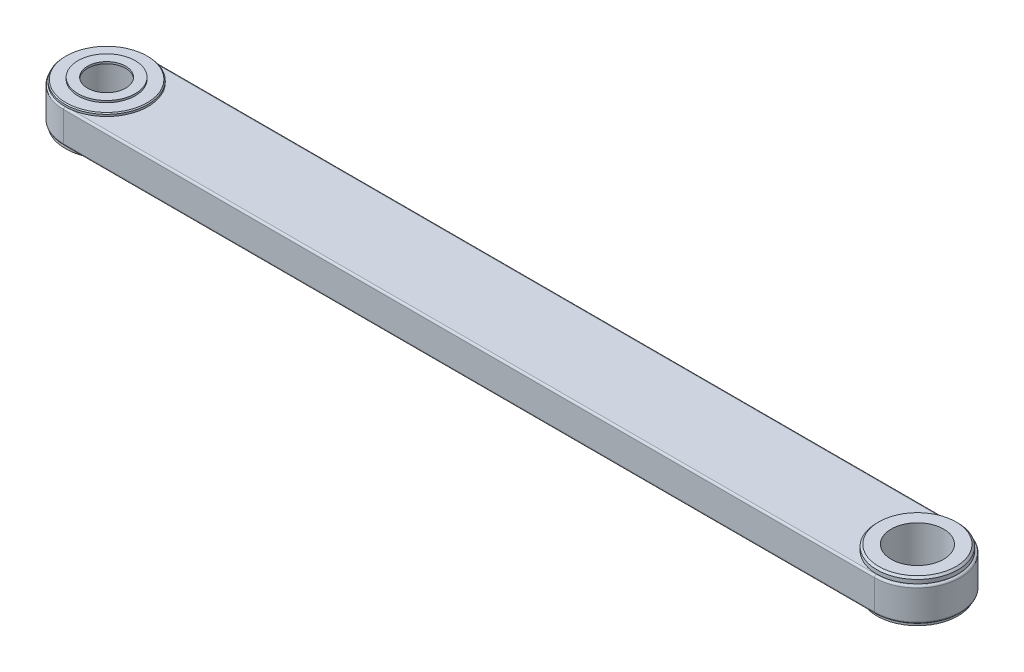
ISO-10303-21;
HEADER;
FILE_DESCRIPTION(('STEP AP214'),'2;1');
FILE_NAME('part.step','',(''),(''),'','','');
FILE_SCHEMA(('AUTOMOTIVE_DESIGN { 1 0 10303 214 1 1 1 1 }'));
ENDSEC;
DATA;
#1=APPLICATION_CONTEXT('core data for automotive mechanical design processes');
#2=APPLICATION_PROTOCOL_DEFINITION('international standard','automotive_design',2000,#1);
#3=PRODUCT_CONTEXT('',#1,'mechanical');
#4=PRODUCT('Part','Part','',(#3));
#5=PRODUCT_RELATED_PRODUCT_CATEGORY('part','',(#4));
#6=PRODUCT_DEFINITION_FORMATION('','',#4);
#7=PRODUCT_DEFINITION_CONTEXT('part definition',#1,'design');
#8=PRODUCT_DEFINITION('design','',#6,#7);
#9=PRODUCT_DEFINITION_SHAPE('','',#8);
#10=(LENGTH_UNIT() NAMED_UNIT(*) SI_UNIT(.MILLI.,.METRE.));
#11=(NAMED_UNIT(*) PLANE_ANGLE_UNIT() SI_UNIT($,.RADIAN.));
#12=(NAMED_UNIT(*) SI_UNIT($,.STERADIAN.) SOLID_ANGLE_UNIT());
#13=UNCERTAINTY_MEASURE_WITH_UNIT(LENGTH_MEASURE(1.E-05),#10,'distance_accuracy_value','');
#14=(GEOMETRIC_REPRESENTATION_CONTEXT(3) GLOBAL_UNCERTAINTY_ASSIGNED_CONTEXT((#13)) GLOBAL_UNIT_ASSIGNED_CONTEXT((#10,
#11,#12)) REPRESENTATION_CONTEXT('',''));
#15=CARTESIAN_POINT('',(0.,0.,0.));
#16=DIRECTION('',(0.,0.,1.));
#17=DIRECTION('',(1.,0.,0.));
#18=AXIS2_PLACEMENT_3D('',#15,#16,#17);
#19=CARTESIAN_POINT('',(1237.10701703495,162.,1587.00959301561));
#20=DIRECTION('',(0.,-1.,0.));
#21=DIRECTION('',(1.,0.,0.));
#22=AXIS2_PLACEMENT_3D('',#19,#20,#21);
#23=CYLINDRICAL_SURFACE('',#22,42.5);
#24=CARTESIAN_POINT('',(1237.10701703495,160.,1587.00959301561));
#25=DIRECTION('',(0.,-1.,0.));
#26=DIRECTION('',(0.,0.,1.));
#27=AXIS2_PLACEMENT_3D('',#24,#25,#26);
#28=CIRCLE('',#27,42.5);
#29=CARTESIAN_POINT('',(1237.10701703495,160.,1629.50959301561));
#30=VERTEX_POINT('',#29);
#31=EDGE_CURVE('E11',#30,#30,#28,.T.);
#32=ORIENTED_EDGE('',*,*,#31,.T.);
#33=EDGE_LOOP('',(#32));
#34=FACE_BOUND('',#33,.T.);
#35=CARTESIAN_POINT('',(1237.10701703495,156.,1587.00959301561));
#36=DIRECTION('',(0.,1.,0.));
#37=DIRECTION('',(0.,0.,1.));
#38=AXIS2_PLACEMENT_3D('',#35,#36,#37);
#39=CIRCLE('',#38,42.5);
#40=CARTESIAN_POINT('',(1237.10701703495,156.,1629.50959301561));
#41=VERTEX_POINT('',#40);
#42=EDGE_CURVE('E52',#41,#41,#39,.T.);
#43=ORIENTED_EDGE('',*,*,#42,.T.);
#44=EDGE_LOOP('',(#43));
#45=FACE_BOUND('',#44,.T.);
#46=ADVANCED_FACE('F42',(#34,#45),#23,.T.);
#47=CARTESIAN_POINT('',(1237.10701703495,162.,1587.00959301561));
#48=DIRECTION('',(0.,1.,0.));
#49=DIRECTION('',(1.,0.,0.));
#50=AXIS2_PLACEMENT_3D('',#47,#48,#49);
#51=PLANE('',#50);
#52=CARTESIAN_POINT('',(1237.10701703495,162.,1587.00959301561));
#53=DIRECTION('',(0.,-1.,0.));
#54=DIRECTION('',(0.,0.,-1.));
#55=AXIS2_PLACEMENT_3D('',#52,#53,#54);
#56=CIRCLE('',#55,27.5);
#57=CARTESIAN_POINT('',(1237.10701703495,162.,1559.50959301561));
#58=VERTEX_POINT('',#57);
#59=EDGE_CURVE('E195',#58,#58,#56,.T.);
#60=ORIENTED_EDGE('',*,*,#59,.T.);
#61=EDGE_LOOP('',(#60));
#62=FACE_BOUND('',#61,.T.);
#63=CARTESIAN_POINT('',(1237.10701703495,162.,1587.00959301561));
#64=DIRECTION('',(0.,1.,0.));
#65=DIRECTION('',(0.,0.,1.));
#66=AXIS2_PLACEMENT_3D('',#63,#64,#65);
#67=CIRCLE('',#66,40.5);
#68=CARTESIAN_POINT('',(1237.10701703495,162.,1627.50959301561));
#69=VERTEX_POINT('',#68);
#70=EDGE_CURVE('E192',#69,#69,#67,.T.);
#71=ORIENTED_EDGE('',*,*,#70,.T.);
#72=EDGE_LOOP('',(#71));
#73=FACE_BOUND('',#72,.T.);
#74=ADVANCED_FACE('F323',(#62,#73),#51,.T.);
#75=CARTESIAN_POINT('',(1237.10701703495,160.,1587.00959301561));
#76=DIRECTION('',(0.,-1.,0.));
#77=DIRECTION('',(0.,0.,-1.));
#78=AXIS2_PLACEMENT_3D('',#75,#76,#77);
#79=CONICAL_SURFACE('',#78,42.5,0.785398162499998);
#80=ORIENTED_EDGE('',*,*,#70,.F.);
#81=EDGE_LOOP('',(#80));
#82=FACE_BOUND('',#81,.T.);
#83=ORIENTED_EDGE('',*,*,#31,.F.);
#84=EDGE_LOOP('',(#83));
#85=FACE_BOUND('',#84,.T.);
#86=ADVANCED_FACE('F329',(#82,#85),#79,.T.);
#87=CARTESIAN_POINT('',(1237.10701703495,156.,1587.00959301562));
#88=DIRECTION('',(0.,-1.,0.));
#89=DIRECTION('',(0.,0.,-1.));
#90=AXIS2_PLACEMENT_3D('',#87,#88,#89);
#91=CYLINDRICAL_SURFACE('',#90,45.);
#92=DIRECTION('',(0.,-1.,0.));
#93=VECTOR('',#92,1.);
#94=CARTESIAN_POINT('',(1237.10701703495,156.,1632.00959301562));
#95=LINE('',#94,#93);
#96=CARTESIAN_POINT('',(1237.10701703495,154.,1632.00959301562));
#97=VERTEX_POINT('',#96);
#98=CARTESIAN_POINT('',(1237.10701703495,123.,1632.00959301562));
#99=VERTEX_POINT('',#98);
#100=EDGE_CURVE('E157',#97,#99,#95,.T.);
#101=ORIENTED_EDGE('',*,*,#100,.T.);
#102=CARTESIAN_POINT('',(1237.10701703495,123.,1587.00959301562));
#103=DIRECTION('',(0.,1.,0.));
#104=DIRECTION('',(0.,0.,1.));
#105=AXIS2_PLACEMENT_3D('',#102,#103,#104);
#106=CIRCLE('',#105,45.);
#107=CARTESIAN_POINT('',(1237.10701703495,123.,1542.00959301562));
#108=VERTEX_POINT('',#107);
#109=EDGE_CURVE('E154',#99,#108,#106,.T.);
#110=ORIENTED_EDGE('',*,*,#109,.T.);
#111=DIRECTION('',(0.,-1.,0.));
#112=VECTOR('',#111,1.);
#113=CARTESIAN_POINT('',(1237.10701703495,156.,1542.00959301562));
#114=LINE('',#113,#112);
#115=CARTESIAN_POINT('',(1237.10701703495,154.,1542.00959301562));
#116=VERTEX_POINT('',#115);
#117=EDGE_CURVE('E179',#116,#108,#114,.T.);
#118=ORIENTED_EDGE('',*,*,#117,.F.);
#119=CARTESIAN_POINT('',(1237.10701703495,154.,1587.00959301562));
#120=DIRECTION('',(0.,-1.,0.));
#121=DIRECTION('',(0.,0.,1.));
#122=AXIS2_PLACEMENT_3D('',#119,#120,#121);
#123=CIRCLE('',#122,45.);
#124=EDGE_CURVE('E158',#116,#97,#123,.T.);
#125=ORIENTED_EDGE('',*,*,#124,.T.);
#126=EDGE_LOOP('',(#101,#110,#118,#125));
#127=FACE_BOUND('',#126,.T.);
#128=ADVANCED_FACE('F418',(#127),#91,.T.);
#129=CARTESIAN_POINT('',(1237.10701703495,156.,1587.00959301562));
#130=DIRECTION('',(0.,1.,0.));
#131=DIRECTION('',(1.,0.,0.));
#132=AXIS2_PLACEMENT_3D('',#129,#130,#131);
#133=PLANE('',#132);
#134=CARTESIAN_POINT('',(387.107017034954,156.,1587.00959301561));
#135=DIRECTION('',(0.,-1.,0.));
#136=DIRECTION('',(0.,0.,1.));
#137=AXIS2_PLACEMENT_3D('',#134,#135,#136);
#138=CIRCLE('',#137,43.5);
#139=CARTESIAN_POINT('',(393.683490253971,156.,1544.00959301562));
#140=VERTEX_POINT('',#139);
#141=CARTESIAN_POINT('',(393.683490253904,156.,1630.00959301562));
#142=VERTEX_POINT('',#141);
#143=EDGE_CURVE('E244',#140,#142,#138,.T.);
#144=ORIENTED_EDGE('',*,*,#143,.T.);
#145=DIRECTION('',(1.,0.,0.));
#146=VECTOR('',#145,1.);
#147=CARTESIAN_POINT('',(1237.10701703495,156.,1630.00959301562));
#148=LINE('',#147,#146);
#149=CARTESIAN_POINT('',(1237.10701703495,156.,1630.00959301562));
#150=VERTEX_POINT('',#149);
#151=EDGE_CURVE('E241',#142,#150,#148,.T.);
#152=ORIENTED_EDGE('',*,*,#151,.T.);
#153=CARTESIAN_POINT('',(1237.10701703495,156.,1587.00959301562));
#154=DIRECTION('',(0.,1.,0.));
#155=DIRECTION('',(0.,0.,1.));
#156=AXIS2_PLACEMENT_3D('',#153,#154,#155);
#157=CIRCLE('',#156,43.);
#158=CARTESIAN_POINT('',(1237.10701703495,156.,1544.00959301562));
#159=VERTEX_POINT('',#158);
#160=EDGE_CURVE('E46',#150,#159,#157,.T.);
#161=ORIENTED_EDGE('',*,*,#160,.T.);
#162=DIRECTION('',(-1.,0.,0.));
#163=VECTOR('',#162,1.);
#164=CARTESIAN_POINT('',(387.107017034954,156.,1544.00959301562));
#165=LINE('',#164,#163);
#166=EDGE_CURVE('E147',#159,#140,#165,.T.);
#167=ORIENTED_EDGE('',*,*,#166,.T.);
#168=EDGE_LOOP('',(#144,#152,#161,#167));
#169=FACE_BOUND('',#168,.T.);
#170=ORIENTED_EDGE('',*,*,#42,.F.);
#171=EDGE_LOOP('',(#170));
#172=FACE_BOUND('',#171,.T.);
#173=ADVANCED_FACE('F304',(#169,#172),#133,.T.);
#174=CARTESIAN_POINT('',(1237.10701703495,121.,1587.00959301562));
#175=DIRECTION('',(0.,1.,0.));
#176=DIRECTION('',(1.,0.,0.));
#177=AXIS2_PLACEMENT_3D('',#174,#175,#176);
#178=PLANE('',#177);
#179=CARTESIAN_POINT('',(1237.10701703495,121.,1587.00959301561));
#180=DIRECTION('',(0.,1.,0.));
#181=DIRECTION('',(0.,0.,-1.));
#182=AXIS2_PLACEMENT_3D('',#179,#180,#181);
#183=CIRCLE('',#182,42.5);
#184=CARTESIAN_POINT('',(1237.10701703495,121.,1544.50959301561));
#185=VERTEX_POINT('',#184);
#186=EDGE_CURVE('E229',#185,#185,#183,.T.);
#187=ORIENTED_EDGE('',*,*,#186,.T.);
#188=EDGE_LOOP('',(#187));
#189=FACE_BOUND('',#188,.T.);
#190=DIRECTION('',(-1.,0.,0.));
#191=VECTOR('',#190,1.);
#192=CARTESIAN_POINT('',(387.107017034954,121.,1630.00959301562));
#193=LINE('',#192,#191);
#194=CARTESIAN_POINT('',(1237.10701703495,121.,1630.00959301562));
#195=VERTEX_POINT('',#194);
#196=CARTESIAN_POINT('',(393.683490253904,121.,1630.00959301562));
#197=VERTEX_POINT('',#196);
#198=EDGE_CURVE('E226',#195,#197,#193,.T.);
#199=ORIENTED_EDGE('',*,*,#198,.T.);
#200=CARTESIAN_POINT('',(387.107017034954,121.,1587.00959301561));
#201=DIRECTION('',(0.,-1.,0.));
#202=DIRECTION('',(0.,0.,1.));
#203=AXIS2_PLACEMENT_3D('',#200,#201,#202);
#204=CIRCLE('',#203,43.5);
#205=CARTESIAN_POINT('',(393.683490253971,121.,1544.00959301562));
#206=VERTEX_POINT('',#205);
#207=EDGE_CURVE('E143',#206,#197,#204,.T.);
#208=ORIENTED_EDGE('',*,*,#207,.F.);
#209=DIRECTION('',(1.,0.,0.));
#210=VECTOR('',#209,1.);
#211=CARTESIAN_POINT('',(1237.10701703495,121.,1544.00959301562));
#212=LINE('',#211,#210);
#213=CARTESIAN_POINT('',(1237.10701703495,121.,1544.00959301562));
#214=VERTEX_POINT('',#213);
#215=EDGE_CURVE('E230',#206,#214,#212,.T.);
#216=ORIENTED_EDGE('',*,*,#215,.T.);
#217=CARTESIAN_POINT('',(1237.10701703495,121.,1587.00959301562));
#218=DIRECTION('',(0.,-1.,0.));
#219=DIRECTION('',(0.,0.,1.));
#220=AXIS2_PLACEMENT_3D('',#217,#218,#219);
#221=CIRCLE('',#220,43.);
#222=EDGE_CURVE('E266',#214,#195,#221,.T.);
#223=ORIENTED_EDGE('',*,*,#222,.T.);
#224=EDGE_LOOP('',(#199,#208,#216,#223));
#225=FACE_BOUND('',#224,.T.);
#226=ADVANCED_FACE('F344',(#189,#225),#178,.F.);
#227=CARTESIAN_POINT('',(1237.10701703495,156.,1632.00959301562));
#228=DIRECTION('',(0.,0.,1.));
#229=DIRECTION('',(1.,0.,0.));
#230=AXIS2_PLACEMENT_3D('',#227,#228,#229);
#231=PLANE('',#230);
#232=DIRECTION('',(0.,-1.,0.));
#233=VECTOR('',#232,1.);
#234=CARTESIAN_POINT('',(387.107017034954,156.,1632.00959301562));
#235=LINE('',#234,#233);
#236=CARTESIAN_POINT('',(387.107017034954,154.,1632.00959301562));
#237=VERTEX_POINT('',#236);
#238=CARTESIAN_POINT('',(387.107017034954,123.,1632.00959301562));
#239=VERTEX_POINT('',#238);
#240=EDGE_CURVE('E175',#237,#239,#235,.T.);
#241=ORIENTED_EDGE('',*,*,#240,.T.);
#242=DIRECTION('',(1.,0.,0.));
#243=VECTOR('',#242,1.);
#244=CARTESIAN_POINT('',(1237.10701703495,123.,1632.00959301562));
#245=LINE('',#244,#243);
#246=EDGE_CURVE('E173',#239,#99,#245,.T.);
#247=ORIENTED_EDGE('',*,*,#246,.T.);
#248=ORIENTED_EDGE('',*,*,#100,.F.);
#249=DIRECTION('',(-1.,0.,0.));
#250=VECTOR('',#249,1.);
#251=CARTESIAN_POINT('',(1237.10701703495,154.,1632.00959301562));
#252=LINE('',#251,#250);
#253=EDGE_CURVE('E176',#97,#237,#252,.T.);
#254=ORIENTED_EDGE('',*,*,#253,.T.);
#255=EDGE_LOOP('',(#241,#247,#248,#254));
#256=FACE_BOUND('',#255,.T.);
#257=ADVANCED_FACE('F340',(#256),#231,.T.);
#258=CARTESIAN_POINT('',(1237.10701703495,156.,1542.00959301562));
#259=DIRECTION('',(0.,0.,1.));
#260=DIRECTION('',(1.,0.,0.));
#261=AXIS2_PLACEMENT_3D('',#258,#259,#260);
#262=PLANE('',#261);
#263=ORIENTED_EDGE('',*,*,#117,.T.);
#264=DIRECTION('',(-1.,0.,0.));
#265=VECTOR('',#264,1.);
#266=CARTESIAN_POINT('',(1237.10701703495,123.,1542.00959301562));
#267=LINE('',#266,#265);
#268=CARTESIAN_POINT('',(387.107017034954,123.,1542.00959301562));
#269=VERTEX_POINT('',#268);
#270=EDGE_CURVE('E225',#108,#269,#267,.T.);
#271=ORIENTED_EDGE('',*,*,#270,.T.);
#272=DIRECTION('',(0.,-1.,0.));
#273=VECTOR('',#272,1.);
#274=CARTESIAN_POINT('',(387.107017034954,156.,1542.00959301562));
#275=LINE('',#274,#273);
#276=CARTESIAN_POINT('',(387.107017034954,154.,1542.00959301562));
#277=VERTEX_POINT('',#276);
#278=EDGE_CURVE('E149',#277,#269,#275,.T.);
#279=ORIENTED_EDGE('',*,*,#278,.F.);
#280=DIRECTION('',(1.,0.,0.));
#281=VECTOR('',#280,1.);
#282=CARTESIAN_POINT('',(1237.10701703495,154.,1542.00959301562));
#283=LINE('',#282,#281);
#284=EDGE_CURVE('E152',#277,#116,#283,.T.);
#285=ORIENTED_EDGE('',*,*,#284,.T.);
#286=EDGE_LOOP('',(#263,#271,#279,#285));
#287=FACE_BOUND('',#286,.T.);
#288=ADVANCED_FACE('F336',(#287),#262,.F.);
#289=CARTESIAN_POINT('',(387.107017034954,156.,1587.00959301562));
#290=DIRECTION('',(0.,-1.,0.));
#291=DIRECTION('',(0.,0.,-1.));
#292=AXIS2_PLACEMENT_3D('',#289,#290,#291);
#293=CYLINDRICAL_SURFACE('',#292,45.);
#294=ORIENTED_EDGE('',*,*,#278,.T.);
#295=CARTESIAN_POINT('',(387.107017034954,123.,1587.00959301562));
#296=DIRECTION('',(0.,1.,0.));
#297=DIRECTION('',(0.,0.,1.));
#298=AXIS2_PLACEMENT_3D('',#295,#296,#297);
#299=CIRCLE('',#298,45.);
#300=EDGE_CURVE('E153',#269,#239,#299,.T.);
#301=ORIENTED_EDGE('',*,*,#300,.T.);
#302=ORIENTED_EDGE('',*,*,#240,.F.);
#303=CARTESIAN_POINT('',(387.107017034954,154.,1587.00959301562));
#304=DIRECTION('',(0.,-1.,0.));
#305=DIRECTION('',(0.,0.,1.));
#306=AXIS2_PLACEMENT_3D('',#303,#304,#305);
#307=CIRCLE('',#306,45.);
#308=EDGE_CURVE('E187',#237,#277,#307,.T.);
#309=ORIENTED_EDGE('',*,*,#308,.T.);
#310=EDGE_LOOP('',(#294,#301,#302,#309));
#311=FACE_BOUND('',#310,.T.);
#312=ADVANCED_FACE('F339',(#311),#293,.T.);
#313=CARTESIAN_POINT('',(387.107017034954,123.,1587.00959301562));
#314=DIRECTION('',(0.,1.,0.));
#315=DIRECTION('',(0.,0.,1.));
#316=AXIS2_PLACEMENT_3D('',#313,#314,#315);
#317=TOROIDAL_SURFACE('',#316,43.,2.);
#318=CARTESIAN_POINT('',(387.107017034954,123.,1544.00959301562));
#319=DIRECTION('',(1.,0.,0.));
#320=DIRECTION('',(0.,0.,-1.));
#321=AXIS2_PLACEMENT_3D('',#318,#319,#320);
#322=CIRCLE('',#321,2.);
#323=CARTESIAN_POINT('',(387.107017034954,121.,1544.00959301562));
#324=VERTEX_POINT('',#323);
#325=EDGE_CURVE('E188',#324,#269,#322,.T.);
#326=ORIENTED_EDGE('',*,*,#325,.F.);
#327=CARTESIAN_POINT('',(387.107017034954,121.,1587.00959301562));
#328=DIRECTION('',(0.,-1.,0.));
#329=DIRECTION('',(0.,0.,1.));
#330=AXIS2_PLACEMENT_3D('',#327,#328,#329);
#331=CIRCLE('',#330,43.);
#332=CARTESIAN_POINT('',(387.107017034954,121.,1630.00959301562));
#333=VERTEX_POINT('',#332);
#334=EDGE_CURVE('E198',#333,#324,#331,.T.);
#335=ORIENTED_EDGE('',*,*,#334,.F.);
#336=CARTESIAN_POINT('',(387.107017034954,123.,1630.00959301562));
#337=DIRECTION('',(1.,0.,0.));
#338=DIRECTION('',(0.,0.,-1.));
#339=AXIS2_PLACEMENT_3D('',#336,#337,#338);
#340=CIRCLE('',#339,2.);
#341=EDGE_CURVE('E184',#239,#333,#340,.T.);
#342=ORIENTED_EDGE('',*,*,#341,.F.);
#343=ORIENTED_EDGE('',*,*,#300,.F.);
#344=EDGE_LOOP('',(#326,#335,#342,#343));
#345=FACE_BOUND('',#344,.T.);
#346=ADVANCED_FACE('F366',(#345),#317,.T.);
#347=CARTESIAN_POINT('',(1237.10701703495,123.,1630.00959301562));
#348=DIRECTION('',(1.,0.,0.));
#349=DIRECTION('',(0.,0.,-1.));
#350=AXIS2_PLACEMENT_3D('',#347,#348,#349);
#351=CYLINDRICAL_SURFACE('',#350,2.);
#352=ORIENTED_EDGE('',*,*,#341,.T.);
#353=DIRECTION('',(-1.,0.,0.));
#354=VECTOR('',#353,1.);
#355=CARTESIAN_POINT('',(1237.10701703495,121.,1630.00959301562));
#356=LINE('',#355,#354);
#357=EDGE_CURVE('E219',#197,#333,#356,.T.);
#358=ORIENTED_EDGE('',*,*,#357,.F.);
#359=ORIENTED_EDGE('',*,*,#198,.F.);
#360=CARTESIAN_POINT('',(1237.10701703495,123.,1630.00959301562));
#361=DIRECTION('',(1.,0.,0.));
#362=DIRECTION('',(0.,0.,-1.));
#363=AXIS2_PLACEMENT_3D('',#360,#361,#362);
#364=CIRCLE('',#363,2.);
#365=EDGE_CURVE('E214',#99,#195,#364,.T.);
#366=ORIENTED_EDGE('',*,*,#365,.F.);
#367=ORIENTED_EDGE('',*,*,#246,.F.);
#368=EDGE_LOOP('',(#352,#358,#359,#366,#367));
#369=FACE_BOUND('',#368,.T.);
#370=ADVANCED_FACE('F436',(#369),#351,.T.);
#371=CARTESIAN_POINT('',(1237.10701703495,123.,1544.00959301562));
#372=DIRECTION('',(-1.,0.,0.));
#373=DIRECTION('',(0.,0.,1.));
#374=AXIS2_PLACEMENT_3D('',#371,#372,#373);
#375=CYLINDRICAL_SURFACE('',#374,2.);
#376=ORIENTED_EDGE('',*,*,#325,.T.);
#377=ORIENTED_EDGE('',*,*,#270,.F.);
#378=CARTESIAN_POINT('',(1237.10701703495,123.,1544.00959301562));
#379=DIRECTION('',(1.,0.,0.));
#380=DIRECTION('',(0.,0.,-1.));
#381=AXIS2_PLACEMENT_3D('',#378,#379,#380);
#382=CIRCLE('',#381,2.);
#383=EDGE_CURVE('E162',#214,#108,#382,.T.);
#384=ORIENTED_EDGE('',*,*,#383,.F.);
#385=ORIENTED_EDGE('',*,*,#215,.F.);
#386=DIRECTION('',(1.,0.,0.));
#387=VECTOR('',#386,1.);
#388=CARTESIAN_POINT('',(1237.10701703495,121.,1544.00959301562));
#389=LINE('',#388,#387);
#390=EDGE_CURVE('E196',#324,#206,#389,.T.);
#391=ORIENTED_EDGE('',*,*,#390,.F.);
#392=EDGE_LOOP('',(#376,#377,#384,#385,#391));
#393=FACE_BOUND('',#392,.T.);
#394=ADVANCED_FACE('F393',(#393),#375,.T.);
#395=CARTESIAN_POINT('',(1237.10701703495,123.,1587.00959301562));
#396=DIRECTION('',(0.,1.,0.));
#397=DIRECTION('',(0.,0.,1.));
#398=AXIS2_PLACEMENT_3D('',#395,#396,#397);
#399=TOROIDAL_SURFACE('',#398,43.,2.);
#400=ORIENTED_EDGE('',*,*,#365,.T.);
#401=ORIENTED_EDGE('',*,*,#222,.F.);
#402=ORIENTED_EDGE('',*,*,#383,.T.);
#403=ORIENTED_EDGE('',*,*,#109,.F.);
#404=EDGE_LOOP('',(#400,#401,#402,#403));
#405=FACE_BOUND('',#404,.T.);
#406=ADVANCED_FACE('F425',(#405),#399,.T.);
#407=CARTESIAN_POINT('',(387.107017034954,154.,1587.00959301562));
#408=DIRECTION('',(0.,1.,0.));
#409=DIRECTION('',(0.,0.,1.));
#410=AXIS2_PLACEMENT_3D('',#407,#408,#409);
#411=TOROIDAL_SURFACE('',#410,43.,2.);
#412=CARTESIAN_POINT('',(387.107017034954,154.,1544.00959301562));
#413=DIRECTION('',(1.,0.,0.));
#414=DIRECTION('',(0.,0.,-1.));
#415=AXIS2_PLACEMENT_3D('',#412,#413,#414);
#416=CIRCLE('',#415,2.);
#417=CARTESIAN_POINT('',(387.107017034954,156.,1544.00959301562));
#418=VERTEX_POINT('',#417);
#419=EDGE_CURVE('E163',#277,#418,#416,.T.);
#420=ORIENTED_EDGE('',*,*,#419,.F.);
#421=ORIENTED_EDGE('',*,*,#308,.F.);
#422=CARTESIAN_POINT('',(387.107017034954,154.,1630.00959301562));
#423=DIRECTION('',(1.,0.,0.));
#424=DIRECTION('',(0.,0.,-1.));
#425=AXIS2_PLACEMENT_3D('',#422,#423,#424);
#426=CIRCLE('',#425,2.);
#427=CARTESIAN_POINT('',(387.107017034954,156.,1630.00959301562));
#428=VERTEX_POINT('',#427);
#429=EDGE_CURVE('E159',#428,#237,#426,.T.);
#430=ORIENTED_EDGE('',*,*,#429,.F.);
#431=CARTESIAN_POINT('',(387.107017034954,156.,1587.00959301562));
#432=DIRECTION('',(0.,1.,0.));
#433=DIRECTION('',(0.,0.,1.));
#434=AXIS2_PLACEMENT_3D('',#431,#432,#433);
#435=CIRCLE('',#434,43.);
#436=EDGE_CURVE('E206',#418,#428,#435,.T.);
#437=ORIENTED_EDGE('',*,*,#436,.F.);
#438=EDGE_LOOP('',(#420,#421,#430,#437));
#439=FACE_BOUND('',#438,.T.);
#440=ADVANCED_FACE('F44',(#439),#411,.T.);
#441=CARTESIAN_POINT('',(1237.10701703495,154.,1630.00959301562));
#442=DIRECTION('',(-1.,0.,0.));
#443=DIRECTION('',(0.,0.,1.));
#444=AXIS2_PLACEMENT_3D('',#441,#442,#443);
#445=CYLINDRICAL_SURFACE('',#444,2.);
#446=ORIENTED_EDGE('',*,*,#429,.T.);
#447=ORIENTED_EDGE('',*,*,#253,.F.);
#448=CARTESIAN_POINT('',(1237.10701703495,154.,1630.00959301562));
#449=DIRECTION('',(1.,0.,0.));
#450=DIRECTION('',(0.,0.,-1.));
#451=AXIS2_PLACEMENT_3D('',#448,#449,#450);
#452=CIRCLE('',#451,2.);
#453=EDGE_CURVE('E169',#150,#97,#452,.T.);
#454=ORIENTED_EDGE('',*,*,#453,.F.);
#455=ORIENTED_EDGE('',*,*,#151,.F.);
#456=DIRECTION('',(1.,0.,0.));
#457=VECTOR('',#456,1.);
#458=CARTESIAN_POINT('',(1237.10701703495,156.,1630.00959301562));
#459=LINE('',#458,#457);
#460=EDGE_CURVE('E210',#428,#142,#459,.T.);
#461=ORIENTED_EDGE('',*,*,#460,.F.);
#462=EDGE_LOOP('',(#446,#447,#454,#455,#461));
#463=FACE_BOUND('',#462,.T.);
#464=ADVANCED_FACE('F298',(#463),#445,.T.);
#465=CARTESIAN_POINT('',(1237.10701703495,154.,1544.00959301562));
#466=DIRECTION('',(1.,0.,0.));
#467=DIRECTION('',(0.,0.,-1.));
#468=AXIS2_PLACEMENT_3D('',#465,#466,#467);
#469=CYLINDRICAL_SURFACE('',#468,2.);
#470=ORIENTED_EDGE('',*,*,#419,.T.);
#471=DIRECTION('',(-1.,0.,0.));
#472=VECTOR('',#471,1.);
#473=CARTESIAN_POINT('',(387.107017034954,156.,1544.00959301562));
#474=LINE('',#473,#472);
#475=EDGE_CURVE('E136',#140,#418,#474,.T.);
#476=ORIENTED_EDGE('',*,*,#475,.F.);
#477=ORIENTED_EDGE('',*,*,#166,.F.);
#478=CARTESIAN_POINT('',(1237.10701703495,154.,1544.00959301562));
#479=DIRECTION('',(1.,0.,0.));
#480=DIRECTION('',(0.,0.,-1.));
#481=AXIS2_PLACEMENT_3D('',#478,#479,#480);
#482=CIRCLE('',#481,2.);
#483=EDGE_CURVE('E172',#116,#159,#482,.T.);
#484=ORIENTED_EDGE('',*,*,#483,.F.);
#485=ORIENTED_EDGE('',*,*,#284,.F.);
#486=EDGE_LOOP('',(#470,#476,#477,#484,#485));
#487=FACE_BOUND('',#486,.T.);
#488=ADVANCED_FACE('F368',(#487),#469,.T.);
#489=CARTESIAN_POINT('',(1237.10701703495,154.,1587.00959301562));
#490=DIRECTION('',(0.,1.,0.));
#491=DIRECTION('',(0.,0.,1.));
#492=AXIS2_PLACEMENT_3D('',#489,#490,#491);
#493=TOROIDAL_SURFACE('',#492,43.,2.);
#494=ORIENTED_EDGE('',*,*,#453,.T.);
#495=ORIENTED_EDGE('',*,*,#124,.F.);
#496=ORIENTED_EDGE('',*,*,#483,.T.);
#497=ORIENTED_EDGE('',*,*,#160,.F.);
#498=EDGE_LOOP('',(#494,#495,#496,#497));
#499=FACE_BOUND('',#498,.T.);
#500=ADVANCED_FACE('F370',(#499),#493,.T.);
#501=CARTESIAN_POINT('',(1237.10701703495,118.,1587.00959301561));
#502=DIRECTION('',(0.,-1.,0.));
#503=DIRECTION('',(0.,0.,-1.));
#504=AXIS2_PLACEMENT_3D('',#501,#502,#503);
#505=PLANE('',#504);
#506=CARTESIAN_POINT('',(1237.10701703495,118.,1587.00959301561));
#507=DIRECTION('',(0.,-1.,0.));
#508=DIRECTION('',(0.,0.,-1.));
#509=AXIS2_PLACEMENT_3D('',#506,#507,#508);
#510=CIRCLE('',#509,27.5);
#511=CARTESIAN_POINT('',(1237.10701703495,118.,1559.50959301561));
#512=VERTEX_POINT('',#511);
#513=EDGE_CURVE('E201',#512,#512,#510,.T.);
#514=ORIENTED_EDGE('',*,*,#513,.F.);
#515=EDGE_LOOP('',(#514));
#516=FACE_BOUND('',#515,.T.);
#517=CARTESIAN_POINT('',(1237.10701703495,118.,1587.00959301561));
#518=DIRECTION('',(0.,1.,0.));
#519=DIRECTION('',(-1.,0.,0.));
#520=AXIS2_PLACEMENT_3D('',#517,#518,#519);
#521=CIRCLE('',#520,42.5);
#522=CARTESIAN_POINT('',(1194.60701703495,118.,1587.00959301561));
#523=VERTEX_POINT('',#522);
#524=EDGE_CURVE('E199',#523,#523,#521,.T.);
#525=ORIENTED_EDGE('',*,*,#524,.F.);
#526=EDGE_LOOP('',(#525));
#527=FACE_BOUND('',#526,.T.);
#528=ADVANCED_FACE('F444',(#516,#527),#505,.T.);
#529=CARTESIAN_POINT('',(1237.10701703495,162.,1587.00959301561));
#530=DIRECTION('',(0.,-1.,0.));
#531=DIRECTION('',(1.,0.,0.));
#532=AXIS2_PLACEMENT_3D('',#529,#530,#531);
#533=CYLINDRICAL_SURFACE('',#532,42.5);
#534=ORIENTED_EDGE('',*,*,#186,.F.);
#535=EDGE_LOOP('',(#534));
#536=FACE_BOUND('',#535,.T.);
#537=ORIENTED_EDGE('',*,*,#524,.T.);
#538=EDGE_LOOP('',(#537));
#539=FACE_BOUND('',#538,.T.);
#540=ADVANCED_FACE('F441',(#536,#539),#533,.T.);
#541=CARTESIAN_POINT('',(1237.10701703495,162.,1587.00959301561));
#542=DIRECTION('',(0.,-1.,0.));
#543=DIRECTION('',(0.,0.,-1.));
#544=AXIS2_PLACEMENT_3D('',#541,#542,#543);
#545=CYLINDRICAL_SURFACE('',#544,27.5);
#546=ORIENTED_EDGE('',*,*,#513,.T.);
#547=EDGE_LOOP('',(#546));
#548=FACE_BOUND('',#547,.T.);
#549=ORIENTED_EDGE('',*,*,#59,.F.);
#550=EDGE_LOOP('',(#549));
#551=FACE_BOUND('',#550,.T.);
#552=ADVANCED_FACE('F319',(#548,#551),#545,.F.);
#553=CARTESIAN_POINT('',(387.107017034954,156.,1587.00959301561));
#554=DIRECTION('',(0.,1.,0.));
#555=DIRECTION('',(1.,0.,0.));
#556=AXIS2_PLACEMENT_3D('',#553,#554,#555);
#557=PLANE('',#556);
#558=ORIENTED_EDGE('',*,*,#436,.T.);
#559=ORIENTED_EDGE('',*,*,#460,.T.);
#560=CARTESIAN_POINT('',(387.107017034954,156.,1587.00959301561));
#561=DIRECTION('',(0.,-1.,0.));
#562=DIRECTION('',(0.,0.,1.));
#563=AXIS2_PLACEMENT_3D('',#560,#561,#562);
#564=CIRCLE('',#563,43.5);
#565=EDGE_CURVE('E140',#142,#140,#564,.T.);
#566=ORIENTED_EDGE('',*,*,#565,.T.);
#567=ORIENTED_EDGE('',*,*,#475,.T.);
#568=EDGE_LOOP('',(#558,#559,#566,#567));
#569=FACE_BOUND('',#568,.T.);
#570=ADVANCED_FACE('F291',(#569),#557,.F.);
#571=CARTESIAN_POINT('',(387.107017034954,117.,1587.00959301561));
#572=DIRECTION('',(0.,1.,0.));
#573=DIRECTION('',(0.,0.,1.));
#574=AXIS2_PLACEMENT_3D('',#571,#572,#573);
#575=CYLINDRICAL_SURFACE('',#574,43.5);
#576=CARTESIAN_POINT('',(387.107017034954,158.,1587.00959301561));
#577=DIRECTION('',(0.,-1.,0.));
#578=DIRECTION('',(0.,0.,1.));
#579=AXIS2_PLACEMENT_3D('',#576,#577,#578);
#580=CIRCLE('',#579,43.5);
#581=CARTESIAN_POINT('',(387.107017034954,158.,1630.50959301561));
#582=VERTEX_POINT('',#581);
#583=EDGE_CURVE('E133',#582,#582,#580,.T.);
#584=ORIENTED_EDGE('',*,*,#583,.T.);
#585=EDGE_LOOP('',(#584));
#586=FACE_BOUND('',#585,.T.);
#587=ORIENTED_EDGE('',*,*,#143,.F.);
#588=ORIENTED_EDGE('',*,*,#565,.F.);
#589=EDGE_LOOP('',(#587,#588));
#590=FACE_BOUND('',#589,.T.);
#591=ADVANCED_FACE('F308',(#586,#590),#575,.T.);
#592=CARTESIAN_POINT('',(387.107017034954,117.,1587.00959301561));
#593=DIRECTION('',(0.,1.,0.));
#594=DIRECTION('',(0.,0.,1.));
#595=AXIS2_PLACEMENT_3D('',#592,#593,#594);
#596=CYLINDRICAL_SURFACE('',#595,43.5);
#597=CARTESIAN_POINT('',(387.107017034954,118.,1587.00959301561));
#598=DIRECTION('',(0.,1.,0.));
#599=DIRECTION('',(0.,0.,-1.));
#600=AXIS2_PLACEMENT_3D('',#597,#598,#599);
#601=CIRCLE('',#600,43.5);
#602=CARTESIAN_POINT('',(387.107017034954,118.,1543.50959301561));
#603=VERTEX_POINT('',#602);
#604=EDGE_CURVE('E137',#603,#603,#601,.T.);
#605=ORIENTED_EDGE('',*,*,#604,.T.);
#606=EDGE_LOOP('',(#605));
#607=FACE_BOUND('',#606,.T.);
#608=ORIENTED_EDGE('',*,*,#207,.T.);
#609=CARTESIAN_POINT('',(387.107017034954,121.,1587.00959301561));
#610=DIRECTION('',(0.,-1.,0.));
#611=DIRECTION('',(0.,0.,1.));
#612=AXIS2_PLACEMENT_3D('',#609,#610,#611);
#613=CIRCLE('',#612,43.5);
#614=EDGE_CURVE('E180',#197,#206,#613,.T.);
#615=ORIENTED_EDGE('',*,*,#614,.T.);
#616=EDGE_LOOP('',(#608,#615));
#617=FACE_BOUND('',#616,.T.);
#618=ADVANCED_FACE('F310',(#607,#617),#596,.T.);
#619=CARTESIAN_POINT('',(387.107017034954,117.,1587.00959301561));
#620=DIRECTION('',(0.,-1.,0.));
#621=DIRECTION('',(0.,0.,-1.));
#622=AXIS2_PLACEMENT_3D('',#619,#620,#621);
#623=PLANE('',#622);
#624=CARTESIAN_POINT('',(387.107017034954,117.,1587.00959301561));
#625=DIRECTION('',(0.,1.,0.));
#626=DIRECTION('',(0.,0.,1.));
#627=AXIS2_PLACEMENT_3D('',#624,#625,#626);
#628=CIRCLE('',#627,27.5);
#629=CARTESIAN_POINT('',(387.107017034954,117.,1614.50959301561));
#630=VERTEX_POINT('',#629);
#631=EDGE_CURVE('E183',#630,#630,#628,.T.);
#632=ORIENTED_EDGE('',*,*,#631,.T.);
#633=EDGE_LOOP('',(#632));
#634=FACE_BOUND('',#633,.T.);
#635=CARTESIAN_POINT('',(387.107017034954,117.,1587.00959301561));
#636=DIRECTION('',(0.,-1.,0.));
#637=DIRECTION('',(0.,0.,-1.));
#638=AXIS2_PLACEMENT_3D('',#635,#636,#637);
#639=CIRCLE('',#638,42.5);
#640=CARTESIAN_POINT('',(387.107017034954,117.,1544.50959301561));
#641=VERTEX_POINT('',#640);
#642=EDGE_CURVE('E222',#641,#641,#639,.T.);
#643=ORIENTED_EDGE('',*,*,#642,.T.);
#644=EDGE_LOOP('',(#643));
#645=FACE_BOUND('',#644,.T.);
#646=ADVANCED_FACE('F316',(#634,#645),#623,.T.);
#647=CARTESIAN_POINT('',(387.107017034954,121.,1587.00959301561));
#648=DIRECTION('',(0.,1.,0.));
#649=DIRECTION('',(1.,0.,0.));
#650=AXIS2_PLACEMENT_3D('',#647,#648,#649);
#651=PLANE('',#650);
#652=ORIENTED_EDGE('',*,*,#614,.F.);
#653=ORIENTED_EDGE('',*,*,#357,.T.);
#654=ORIENTED_EDGE('',*,*,#334,.T.);
#655=ORIENTED_EDGE('',*,*,#390,.T.);
#656=EDGE_LOOP('',(#652,#653,#654,#655));
#657=FACE_BOUND('',#656,.T.);
#658=ADVANCED_FACE('F350',(#657),#651,.T.);
#659=CARTESIAN_POINT('',(387.107017034954,160.,1587.00959301561));
#660=DIRECTION('',(0.,1.,0.));
#661=DIRECTION('',(0.,0.,1.));
#662=AXIS2_PLACEMENT_3D('',#659,#660,#661);
#663=CYLINDRICAL_SURFACE('',#662,30.);
#664=CARTESIAN_POINT('',(387.107017034954,161.,1587.00959301561));
#665=DIRECTION('',(0.,1.,0.));
#666=DIRECTION('',(0.,0.,1.));
#667=AXIS2_PLACEMENT_3D('',#664,#665,#666);
#668=CIRCLE('',#667,30.);
#669=CARTESIAN_POINT('',(387.107017034954,161.,1617.00959301561));
#670=VERTEX_POINT('',#669);
#671=EDGE_CURVE('E168',#670,#670,#668,.T.);
#672=ORIENTED_EDGE('',*,*,#671,.F.);
#673=EDGE_LOOP('',(#672));
#674=FACE_BOUND('',#673,.T.);
#675=CARTESIAN_POINT('',(387.107017034954,159.,1587.00959301561));
#676=DIRECTION('',(0.,1.,0.));
#677=DIRECTION('',(0.,0.,1.));
#678=AXIS2_PLACEMENT_3D('',#675,#676,#677);
#679=CIRCLE('',#678,30.);
#680=CARTESIAN_POINT('',(387.107017034954,159.,1617.00959301561));
#681=VERTEX_POINT('',#680);
#682=EDGE_CURVE('E191',#681,#681,#679,.T.);
#683=ORIENTED_EDGE('',*,*,#682,.T.);
#684=EDGE_LOOP('',(#683));
#685=FACE_BOUND('',#684,.T.);
#686=ADVANCED_FACE('F352',(#674,#685),#663,.T.);
#687=CARTESIAN_POINT('',(387.107017034954,159.,1587.00959301561));
#688=DIRECTION('',(0.,1.,0.));
#689=DIRECTION('',(1.,0.,0.));
#690=AXIS2_PLACEMENT_3D('',#687,#688,#689);
#691=PLANE('',#690);
#692=CARTESIAN_POINT('',(387.107017034954,159.,1587.00959301561));
#693=DIRECTION('',(0.,1.,0.));
#694=DIRECTION('',(0.,0.,1.));
#695=AXIS2_PLACEMENT_3D('',#692,#693,#694);
#696=CIRCLE('',#695,42.5);
#697=CARTESIAN_POINT('',(387.107017034954,159.,1629.50959301561));
#698=VERTEX_POINT('',#697);
#699=EDGE_CURVE('E167',#698,#698,#696,.T.);
#700=ORIENTED_EDGE('',*,*,#699,.T.);
#701=EDGE_LOOP('',(#700));
#702=FACE_BOUND('',#701,.T.);
#703=ORIENTED_EDGE('',*,*,#682,.F.);
#704=EDGE_LOOP('',(#703));
#705=FACE_BOUND('',#704,.T.);
#706=ADVANCED_FACE('F348',(#702,#705),#691,.T.);
#707=CARTESIAN_POINT('',(387.107017034954,161.,1587.00959301561));
#708=DIRECTION('',(0.,1.,0.));
#709=DIRECTION('',(1.,0.,0.));
#710=AXIS2_PLACEMENT_3D('',#707,#708,#709);
#711=PLANE('',#710);
#712=CARTESIAN_POINT('',(387.107017034954,161.,1587.00959301561));
#713=DIRECTION('',(0.,-1.,0.));
#714=DIRECTION('',(0.,0.,-1.));
#715=AXIS2_PLACEMENT_3D('',#712,#713,#714);
#716=CIRCLE('',#715,20.);
#717=CARTESIAN_POINT('',(387.107017034954,161.,1567.00959301561));
#718=VERTEX_POINT('',#717);
#719=EDGE_CURVE('E164',#718,#718,#716,.T.);
#720=ORIENTED_EDGE('',*,*,#719,.T.);
#721=EDGE_LOOP('',(#720));
#722=FACE_BOUND('',#721,.T.);
#723=ORIENTED_EDGE('',*,*,#671,.T.);
#724=EDGE_LOOP('',(#723));
#725=FACE_BOUND('',#724,.T.);
#726=ADVANCED_FACE('F345',(#722,#725),#711,.T.);
#727=CARTESIAN_POINT('',(387.107017034954,158.,1587.00959301561));
#728=DIRECTION('',(0.,-1.,0.));
#729=DIRECTION('',(0.,0.,-1.));
#730=AXIS2_PLACEMENT_3D('',#727,#728,#729);
#731=CONICAL_SURFACE('',#730,43.5,0.7853981625);
#732=ORIENTED_EDGE('',*,*,#699,.F.);
#733=EDGE_LOOP('',(#732));
#734=FACE_BOUND('',#733,.T.);
#735=ORIENTED_EDGE('',*,*,#583,.F.);
#736=EDGE_LOOP('',(#735));
#737=FACE_BOUND('',#736,.T.);
#738=ADVANCED_FACE('F134',(#734,#737),#731,.T.);
#739=CARTESIAN_POINT('',(387.107017034954,118.,1587.00959301561));
#740=DIRECTION('',(0.,1.,0.));
#741=DIRECTION('',(0.,0.,1.));
#742=AXIS2_PLACEMENT_3D('',#739,#740,#741);
#743=CONICAL_SURFACE('',#742,43.5,0.785398162500002);
#744=ORIENTED_EDGE('',*,*,#642,.F.);
#745=EDGE_LOOP('',(#744));
#746=FACE_BOUND('',#745,.T.);
#747=ORIENTED_EDGE('',*,*,#604,.F.);
#748=EDGE_LOOP('',(#747));
#749=FACE_BOUND('',#748,.T.);
#750=ADVANCED_FACE('F359',(#746,#749),#743,.T.);
#751=CARTESIAN_POINT('',(387.107017034954,161.,1587.00959301561));
#752=DIRECTION('',(0.,-1.,0.));
#753=DIRECTION('',(0.,0.,-1.));
#754=AXIS2_PLACEMENT_3D('',#751,#752,#753);
#755=CYLINDRICAL_SURFACE('',#754,20.);
#756=CARTESIAN_POINT('',(387.107017034954,159.,1587.00959301561));
#757=DIRECTION('',(0.,-1.,0.));
#758=DIRECTION('',(0.,0.,1.));
#759=AXIS2_PLACEMENT_3D('',#756,#757,#758);
#760=CIRCLE('',#759,20.);
#761=CARTESIAN_POINT('',(387.107017034954,159.,1607.00959301561));
#762=VERTEX_POINT('',#761);
#763=EDGE_CURVE('E257',#762,#762,#760,.T.);
#764=ORIENTED_EDGE('',*,*,#763,.T.);
#765=EDGE_LOOP('',(#764));
#766=FACE_BOUND('',#765,.T.);
#767=ORIENTED_EDGE('',*,*,#719,.F.);
#768=EDGE_LOOP('',(#767));
#769=FACE_BOUND('',#768,.T.);
#770=ADVANCED_FACE('F355',(#766,#769),#755,.F.);
#771=CARTESIAN_POINT('',(387.107017034954,159.,1587.00959301561));
#772=DIRECTION('',(0.,1.,0.));
#773=DIRECTION('',(1.,0.,0.));
#774=AXIS2_PLACEMENT_3D('',#771,#772,#773);
#775=PLANE('',#774);
#776=CARTESIAN_POINT('',(387.107017034954,159.,1587.00959301561));
#777=DIRECTION('',(0.,1.,0.));
#778=DIRECTION('',(0.,0.,1.));
#779=AXIS2_PLACEMENT_3D('',#776,#777,#778);
#780=CIRCLE('',#779,27.5);
#781=CARTESIAN_POINT('',(387.107017034954,159.,1614.50959301561));
#782=VERTEX_POINT('',#781);
#783=EDGE_CURVE('E280',#782,#782,#780,.T.);
#784=ORIENTED_EDGE('',*,*,#783,.F.);
#785=EDGE_LOOP('',(#784));
#786=FACE_BOUND('',#785,.T.);
#787=ORIENTED_EDGE('',*,*,#763,.F.);
#788=EDGE_LOOP('',(#787));
#789=FACE_BOUND('',#788,.T.);
#790=ADVANCED_FACE('F358',(#786,#789),#775,.F.);
#791=CARTESIAN_POINT('',(387.107017034954,117.,1587.00959301561));
#792=DIRECTION('',(0.,1.,0.));
#793=DIRECTION('',(0.,0.,1.));
#794=AXIS2_PLACEMENT_3D('',#791,#792,#793);
#795=CYLINDRICAL_SURFACE('',#794,27.5);
#796=ORIENTED_EDGE('',*,*,#783,.T.);
#797=EDGE_LOOP('',(#796));
#798=FACE_BOUND('',#797,.T.);
#799=ORIENTED_EDGE('',*,*,#631,.F.);
#800=EDGE_LOOP('',(#799));
#801=FACE_BOUND('',#800,.T.);
#802=ADVANCED_FACE('F449',(#798,#801),#795,.F.);
#803=CLOSED_SHELL('',(#46,#74,#86,#128,#173,#226,#257,#288,#312,#346,#370,#394,#406,#440,#464,
#488,#500,#528,#540,#552,#570,#591,#618,#646,#658,#686,#706,#726,#738,#750,#770,#790,#802));
#804=MANIFOLD_SOLID_BREP('B2',#803);
#805=ADVANCED_BREP_SHAPE_REPRESENTATION('',(#18,#804),#14);
#806=SHAPE_DEFINITION_REPRESENTATION(#9,#805);
ENDSEC;
END-ISO-10303-21;
